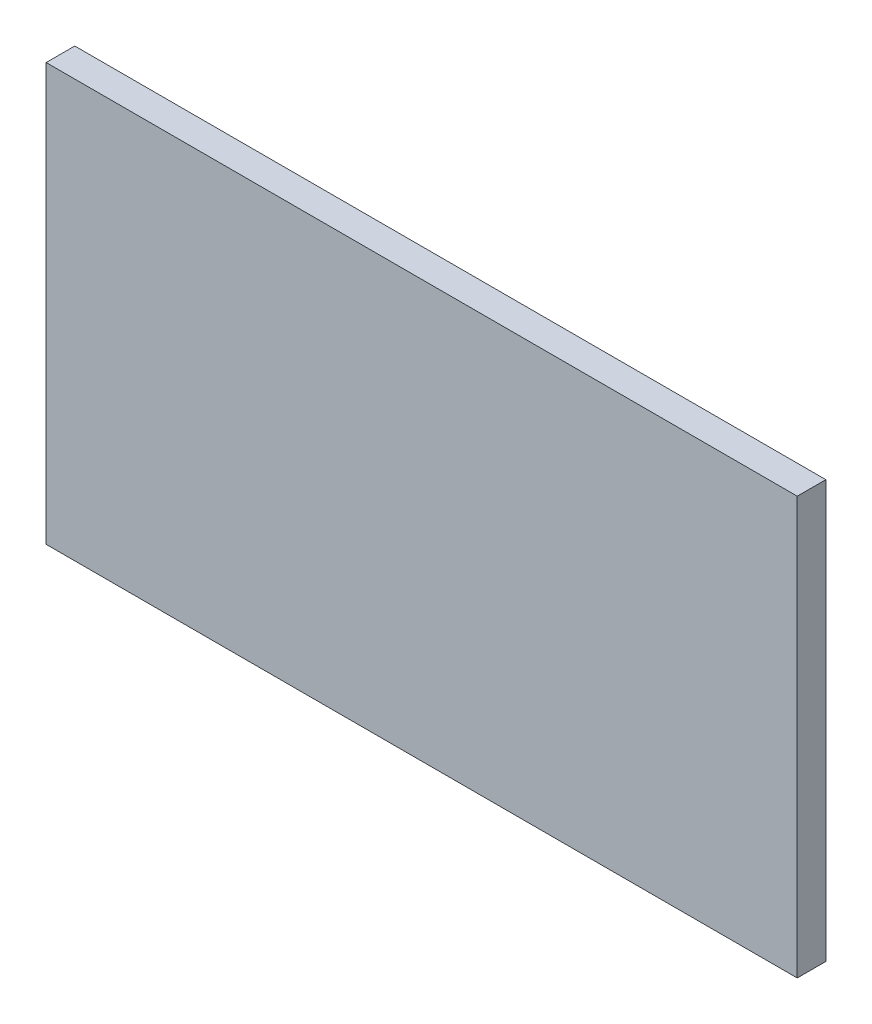
ISO-10303-21;
HEADER;
FILE_DESCRIPTION(('STEP AP214'),'2;1');
FILE_NAME('part.step','',(''),(''),'','','');
FILE_SCHEMA(('AUTOMOTIVE_DESIGN { 1 0 10303 214 1 1 1 1 }'));
ENDSEC;
DATA;
#1=APPLICATION_CONTEXT('core data for automotive mechanical design processes');
#2=APPLICATION_PROTOCOL_DEFINITION('international standard','automotive_design',2000,#1);
#3=PRODUCT_CONTEXT('',#1,'mechanical');
#4=PRODUCT('Part','Part','',(#3));
#5=PRODUCT_RELATED_PRODUCT_CATEGORY('part','',(#4));
#6=PRODUCT_DEFINITION_FORMATION('','',#4);
#7=PRODUCT_DEFINITION_CONTEXT('part definition',#1,'design');
#8=PRODUCT_DEFINITION('design','',#6,#7);
#9=PRODUCT_DEFINITION_SHAPE('','',#8);
#10=(LENGTH_UNIT() NAMED_UNIT(*) SI_UNIT(.MILLI.,.METRE.));
#11=(NAMED_UNIT(*) PLANE_ANGLE_UNIT() SI_UNIT($,.RADIAN.));
#12=(NAMED_UNIT(*) SI_UNIT($,.STERADIAN.) SOLID_ANGLE_UNIT());
#13=UNCERTAINTY_MEASURE_WITH_UNIT(LENGTH_MEASURE(1.E-05),#10,'distance_accuracy_value','');
#14=(GEOMETRIC_REPRESENTATION_CONTEXT(3) GLOBAL_UNCERTAINTY_ASSIGNED_CONTEXT((#13)) GLOBAL_UNIT_ASSIGNED_CONTEXT((#10,
#11,#12)) REPRESENTATION_CONTEXT('',''));
#15=CARTESIAN_POINT('',(0.,0.,0.));
#16=DIRECTION('',(0.,0.,1.));
#17=DIRECTION('',(1.,0.,0.));
#18=AXIS2_PLACEMENT_3D('',#15,#16,#17);
#19=CARTESIAN_POINT('',(12.50008,6.4,0.));
#20=DIRECTION('',(0.,0.,-1.));
#21=DIRECTION('',(-1.,0.,0.));
#22=AXIS2_PLACEMENT_3D('',#19,#20,#21);
#23=PLANE('',#22);
#24=DIRECTION('',(1.,0.,0.));
#25=VECTOR('',#24,1.);
#26=CARTESIAN_POINT('',(12.05008,6.65,0.));
#27=LINE('',#26,#25);
#28=CARTESIAN_POINT('',(12.05008,6.65,0.));
#29=VERTEX_POINT('',#28);
#30=CARTESIAN_POINT('',(12.95008,6.65,0.));
#31=VERTEX_POINT('',#30);
#32=EDGE_CURVE('E55',#29,#31,#27,.T.);
#33=ORIENTED_EDGE('',*,*,#32,.T.);
#34=DIRECTION('',(0.,1.,0.));
#35=VECTOR('',#34,1.);
#36=CARTESIAN_POINT('',(12.95008,6.65,0.));
#37=LINE('',#36,#35);
#38=CARTESIAN_POINT('',(12.95008,6.15,0.));
#39=VERTEX_POINT('',#38);
#40=EDGE_CURVE('E57',#31,#39,#37,.F.);
#41=ORIENTED_EDGE('',*,*,#40,.T.);
#42=DIRECTION('',(1.,0.,0.));
#43=VECTOR('',#42,1.);
#44=CARTESIAN_POINT('',(12.95008,6.15,0.));
#45=LINE('',#44,#43);
#46=CARTESIAN_POINT('',(12.05008,6.15,0.));
#47=VERTEX_POINT('',#46);
#48=EDGE_CURVE('E20',#39,#47,#45,.F.);
#49=ORIENTED_EDGE('',*,*,#48,.T.);
#50=DIRECTION('',(0.,1.,0.));
#51=VECTOR('',#50,1.);
#52=CARTESIAN_POINT('',(12.05008,6.15,0.));
#53=LINE('',#52,#51);
#54=EDGE_CURVE('E80',#47,#29,#53,.T.);
#55=ORIENTED_EDGE('',*,*,#54,.T.);
#56=EDGE_LOOP('',(#33,#41,#49,#55));
#57=FACE_BOUND('',#56,.T.);
#58=ADVANCED_FACE('F17',(#57),#23,.T.);
#59=CARTESIAN_POINT('',(12.95008,6.15,0.));
#60=DIRECTION('',(0.,1.,0.));
#61=DIRECTION('',(0.,0.,1.));
#62=AXIS2_PLACEMENT_3D('',#59,#60,#61);
#63=PLANE('',#62);
#64=DIRECTION('',(0.,0.,-1.));
#65=VECTOR('',#64,1.);
#66=CARTESIAN_POINT('',(12.05008,6.15,0.));
#67=LINE('',#66,#65);
#68=CARTESIAN_POINT('',(12.05008,6.15,0.03429));
#69=VERTEX_POINT('',#68);
#70=EDGE_CURVE('E68',#69,#47,#67,.T.);
#71=ORIENTED_EDGE('',*,*,#70,.T.);
#72=ORIENTED_EDGE('',*,*,#48,.F.);
#73=DIRECTION('',(0.,0.,1.));
#74=VECTOR('',#73,1.);
#75=CARTESIAN_POINT('',(12.95008,6.15,0.));
#76=LINE('',#75,#74);
#77=CARTESIAN_POINT('',(12.95008,6.15,0.03429));
#78=VERTEX_POINT('',#77);
#79=EDGE_CURVE('E63',#39,#78,#76,.T.);
#80=ORIENTED_EDGE('',*,*,#79,.T.);
#81=DIRECTION('',(1.,0.,0.));
#82=VECTOR('',#81,1.);
#83=CARTESIAN_POINT('',(12.50008,6.15,0.03429));
#84=LINE('',#83,#82);
#85=EDGE_CURVE('E83',#69,#78,#84,.T.);
#86=ORIENTED_EDGE('',*,*,#85,.F.);
#87=EDGE_LOOP('',(#71,#72,#80,#86));
#88=FACE_BOUND('',#87,.T.);
#89=ADVANCED_FACE('F65',(#88),#63,.F.);
#90=CARTESIAN_POINT('',(12.95008,6.65,0.));
#91=DIRECTION('',(-1.,0.,0.));
#92=DIRECTION('',(0.,0.,1.));
#93=AXIS2_PLACEMENT_3D('',#90,#91,#92);
#94=PLANE('',#93);
#95=ORIENTED_EDGE('',*,*,#79,.F.);
#96=ORIENTED_EDGE('',*,*,#40,.F.);
#97=DIRECTION('',(0.,0.,-1.));
#98=VECTOR('',#97,1.);
#99=CARTESIAN_POINT('',(12.95008,6.65,0.));
#100=LINE('',#99,#98);
#101=CARTESIAN_POINT('',(12.95008,6.65,0.03429));
#102=VERTEX_POINT('',#101);
#103=EDGE_CURVE('E75',#31,#102,#100,.F.);
#104=ORIENTED_EDGE('',*,*,#103,.T.);
#105=DIRECTION('',(0.,1.,0.));
#106=VECTOR('',#105,1.);
#107=CARTESIAN_POINT('',(12.95008,6.4,0.03429));
#108=LINE('',#107,#106);
#109=EDGE_CURVE('E72',#78,#102,#108,.T.);
#110=ORIENTED_EDGE('',*,*,#109,.F.);
#111=EDGE_LOOP('',(#95,#96,#104,#110));
#112=FACE_BOUND('',#111,.T.);
#113=ADVANCED_FACE('F70',(#112),#94,.F.);
#114=CARTESIAN_POINT('',(12.05008,6.65,0.));
#115=DIRECTION('',(0.,-1.,0.));
#116=DIRECTION('',(0.,0.,-1.));
#117=AXIS2_PLACEMENT_3D('',#114,#115,#116);
#118=PLANE('',#117);
#119=ORIENTED_EDGE('',*,*,#103,.F.);
#120=ORIENTED_EDGE('',*,*,#32,.F.);
#121=DIRECTION('',(0.,0.,-1.));
#122=VECTOR('',#121,1.);
#123=CARTESIAN_POINT('',(12.05008,6.65,0.));
#124=LINE('',#123,#122);
#125=CARTESIAN_POINT('',(12.05008,6.65,0.03429));
#126=VERTEX_POINT('',#125);
#127=EDGE_CURVE('E35',#29,#126,#124,.F.);
#128=ORIENTED_EDGE('',*,*,#127,.T.);
#129=DIRECTION('',(1.,0.,0.));
#130=VECTOR('',#129,1.);
#131=CARTESIAN_POINT('',(12.50008,6.65,0.03429));
#132=LINE('',#131,#130);
#133=EDGE_CURVE('E26',#102,#126,#132,.F.);
#134=ORIENTED_EDGE('',*,*,#133,.F.);
#135=EDGE_LOOP('',(#119,#120,#128,#134));
#136=FACE_BOUND('',#135,.T.);
#137=ADVANCED_FACE('F89',(#136),#118,.F.);
#138=CARTESIAN_POINT('',(12.05008,6.15,0.));
#139=DIRECTION('',(1.,0.,0.));
#140=DIRECTION('',(0.,0.,-1.));
#141=AXIS2_PLACEMENT_3D('',#138,#139,#140);
#142=PLANE('',#141);
#143=ORIENTED_EDGE('',*,*,#127,.F.);
#144=ORIENTED_EDGE('',*,*,#54,.F.);
#145=ORIENTED_EDGE('',*,*,#70,.F.);
#146=DIRECTION('',(0.,1.,0.));
#147=VECTOR('',#146,1.);
#148=CARTESIAN_POINT('',(12.05008,6.4,0.03429));
#149=LINE('',#148,#147);
#150=EDGE_CURVE('E11',#126,#69,#149,.F.);
#151=ORIENTED_EDGE('',*,*,#150,.F.);
#152=EDGE_LOOP('',(#143,#144,#145,#151));
#153=FACE_BOUND('',#152,.T.);
#154=ADVANCED_FACE('F91',(#153),#142,.F.);
#155=CARTESIAN_POINT('',(12.50008,6.4,0.03429));
#156=DIRECTION('',(0.,0.,1.));
#157=DIRECTION('',(1.,0.,0.));
#158=AXIS2_PLACEMENT_3D('',#155,#156,#157);
#159=PLANE('',#158);
#160=ORIENTED_EDGE('',*,*,#133,.T.);
#161=ORIENTED_EDGE('',*,*,#150,.T.);
#162=ORIENTED_EDGE('',*,*,#85,.T.);
#163=ORIENTED_EDGE('',*,*,#109,.T.);
#164=EDGE_LOOP('',(#160,#161,#162,#163));
#165=FACE_BOUND('',#164,.T.);
#166=ADVANCED_FACE('F88',(#165),#159,.T.);
#167=CLOSED_SHELL('',(#58,#89,#113,#137,#154,#166));
#168=MANIFOLD_SOLID_BREP('B1',#167);
#169=ADVANCED_BREP_SHAPE_REPRESENTATION('',(#18,#168),#14);
#170=SHAPE_DEFINITION_REPRESENTATION(#9,#169);
ENDSEC;
END-ISO-10303-21;
